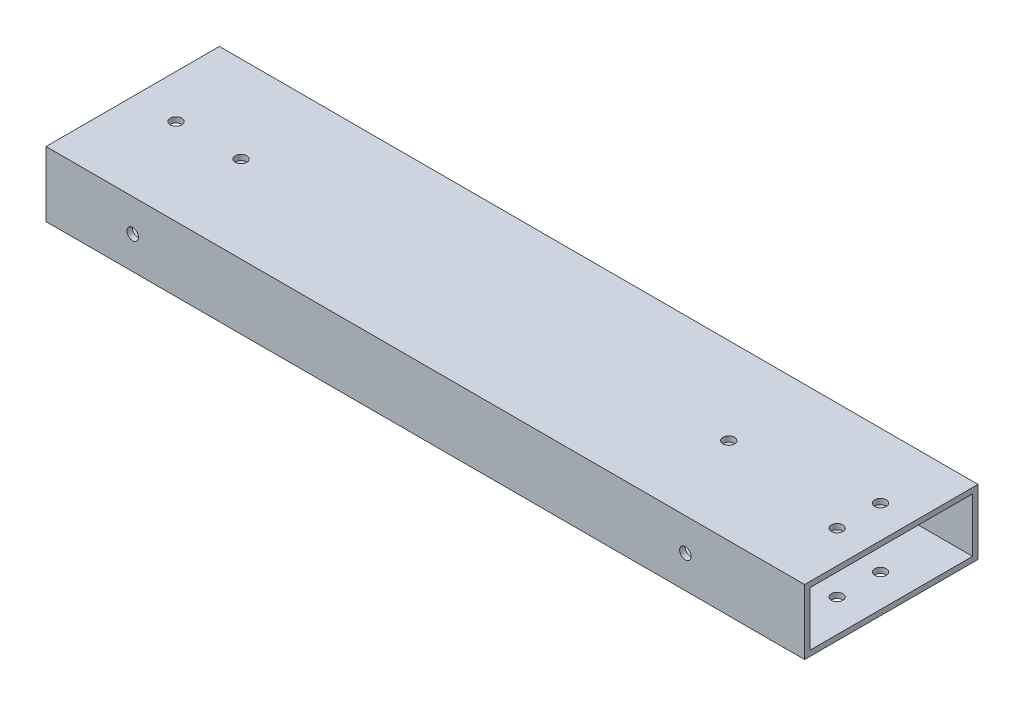
ISO-10303-21;
HEADER;
FILE_DESCRIPTION(('STEP AP214'),'2;1');
FILE_NAME('part.step','',(''),(''),'','','');
FILE_SCHEMA(('AUTOMOTIVE_DESIGN { 1 0 10303 214 1 1 1 1 }'));
ENDSEC;
DATA;
#1=APPLICATION_CONTEXT('core data for automotive mechanical design processes');
#2=APPLICATION_PROTOCOL_DEFINITION('international standard','automotive_design',2000,#1);
#3=PRODUCT_CONTEXT('',#1,'mechanical');
#4=PRODUCT('Part','Part','',(#3));
#5=PRODUCT_RELATED_PRODUCT_CATEGORY('part','',(#4));
#6=PRODUCT_DEFINITION_FORMATION('','',#4);
#7=PRODUCT_DEFINITION_CONTEXT('part definition',#1,'design');
#8=PRODUCT_DEFINITION('design','',#6,#7);
#9=PRODUCT_DEFINITION_SHAPE('','',#8);
#10=(LENGTH_UNIT() NAMED_UNIT(*) SI_UNIT(.MILLI.,.METRE.));
#11=(NAMED_UNIT(*) PLANE_ANGLE_UNIT() SI_UNIT($,.RADIAN.));
#12=(NAMED_UNIT(*) SI_UNIT($,.STERADIAN.) SOLID_ANGLE_UNIT());
#13=UNCERTAINTY_MEASURE_WITH_UNIT(LENGTH_MEASURE(1.E-05),#10,'distance_accuracy_value','');
#14=(GEOMETRIC_REPRESENTATION_CONTEXT(3) GLOBAL_UNCERTAINTY_ASSIGNED_CONTEXT((#13)) GLOBAL_UNIT_ASSIGNED_CONTEXT((#10,
#11,#12)) REPRESENTATION_CONTEXT('',''));
#15=CARTESIAN_POINT('',(0.,0.,0.));
#16=DIRECTION('',(0.,0.,1.));
#17=DIRECTION('',(1.,0.,0.));
#18=AXIS2_PLACEMENT_3D('',#15,#16,#17);
#19=CARTESIAN_POINT('',(444.5,-15.875,0.));
#20=DIRECTION('',(0.,-1.,0.));
#21=DIRECTION('',(0.,0.,-1.));
#22=AXIS2_PLACEMENT_3D('',#19,#20,#21);
#23=PLANE('',#22);
#24=CARTESIAN_POINT('',(25.4,-15.875,0.));
#25=DIRECTION('',(0.,-1.,0.));
#26=DIRECTION('',(0.,0.,-1.));
#27=AXIS2_PLACEMENT_3D('',#24,#25,#26);
#28=CIRCLE('',#27,3.37819999999999);
#29=CARTESIAN_POINT('',(25.4,-15.875,-3.37819999999999));
#30=VERTEX_POINT('',#29);
#31=EDGE_CURVE('E235',#30,#30,#28,.T.);
#32=ORIENTED_EDGE('',*,*,#31,.T.);
#33=EDGE_LOOP('',(#32));
#34=FACE_BOUND('',#33,.T.);
#35=CARTESIAN_POINT('',(63.5,-15.875,0.));
#36=DIRECTION('',(0.,-1.,0.));
#37=DIRECTION('',(0.,0.,-1.));
#38=AXIS2_PLACEMENT_3D('',#35,#36,#37);
#39=CIRCLE('',#38,3.37819999999998);
#40=CARTESIAN_POINT('',(63.5,-15.875,-3.37819999999998));
#41=VERTEX_POINT('',#40);
#42=EDGE_CURVE('E223',#41,#41,#39,.T.);
#43=ORIENTED_EDGE('',*,*,#42,.T.);
#44=EDGE_LOOP('',(#43));
#45=FACE_BOUND('',#44,.T.);
#46=CARTESIAN_POINT('',(349.25,-15.875,0.));
#47=DIRECTION('',(0.,-1.,0.));
#48=DIRECTION('',(0.,0.,-1.));
#49=AXIS2_PLACEMENT_3D('',#46,#47,#48);
#50=CIRCLE('',#49,3.3782);
#51=CARTESIAN_POINT('',(349.25,-15.875,-3.3782));
#52=VERTEX_POINT('',#51);
#53=EDGE_CURVE('E211',#52,#52,#50,.T.);
#54=ORIENTED_EDGE('',*,*,#53,.T.);
#55=EDGE_LOOP('',(#54));
#56=FACE_BOUND('',#55,.T.);
#57=CARTESIAN_POINT('',(425.45,-15.875,-12.7));
#58=DIRECTION('',(0.,-1.,0.));
#59=DIRECTION('',(0.,0.,-1.));
#60=AXIS2_PLACEMENT_3D('',#57,#58,#59);
#61=CIRCLE('',#60,3.3782);
#62=CARTESIAN_POINT('',(425.45,-15.875,-16.0782));
#63=VERTEX_POINT('',#62);
#64=EDGE_CURVE('E199',#63,#63,#61,.T.);
#65=ORIENTED_EDGE('',*,*,#64,.T.);
#66=EDGE_LOOP('',(#65));
#67=FACE_BOUND('',#66,.T.);
#68=CARTESIAN_POINT('',(425.45,-15.875,12.7));
#69=DIRECTION('',(0.,-1.,0.));
#70=DIRECTION('',(0.,0.,-1.));
#71=AXIS2_PLACEMENT_3D('',#68,#69,#70);
#72=CIRCLE('',#71,3.3782);
#73=CARTESIAN_POINT('',(425.45,-15.875,9.3218));
#74=VERTEX_POINT('',#73);
#75=EDGE_CURVE('E137',#74,#74,#72,.T.);
#76=ORIENTED_EDGE('',*,*,#75,.T.);
#77=EDGE_LOOP('',(#76));
#78=FACE_BOUND('',#77,.T.);
#79=DIRECTION('',(0.,0.,1.));
#80=VECTOR('',#79,1.);
#81=CARTESIAN_POINT('',(0.,-15.875,0.));
#82=LINE('',#81,#80);
#83=CARTESIAN_POINT('',(0.,-15.875,-47.625));
#84=VERTEX_POINT('',#83);
#85=CARTESIAN_POINT('',(0.,-15.875,47.625));
#86=VERTEX_POINT('',#85);
#87=EDGE_CURVE('E146',#84,#86,#82,.T.);
#88=ORIENTED_EDGE('',*,*,#87,.T.);
#89=DIRECTION('',(-1.,0.,0.));
#90=VECTOR('',#89,1.);
#91=CARTESIAN_POINT('',(444.5,-15.875,47.625));
#92=LINE('',#91,#90);
#93=CARTESIAN_POINT('',(444.5,-15.875,47.625));
#94=VERTEX_POINT('',#93);
#95=EDGE_CURVE('E11',#94,#86,#92,.T.);
#96=ORIENTED_EDGE('',*,*,#95,.F.);
#97=DIRECTION('',(0.,0.,1.));
#98=VECTOR('',#97,1.);
#99=CARTESIAN_POINT('',(444.5,-15.875,0.));
#100=LINE('',#99,#98);
#101=CARTESIAN_POINT('',(444.5,-15.875,-47.625));
#102=VERTEX_POINT('',#101);
#103=EDGE_CURVE('E116',#102,#94,#100,.T.);
#104=ORIENTED_EDGE('',*,*,#103,.F.);
#105=DIRECTION('',(-1.,0.,0.));
#106=VECTOR('',#105,1.);
#107=CARTESIAN_POINT('',(444.5,-15.875,-47.625));
#108=LINE('',#107,#106);
#109=EDGE_CURVE('E55',#102,#84,#108,.T.);
#110=ORIENTED_EDGE('',*,*,#109,.T.);
#111=EDGE_LOOP('',(#88,#96,#104,#110));
#112=FACE_BOUND('',#111,.T.);
#113=ADVANCED_FACE('F36',(#34,#45,#56,#67,#78,#112),#23,.F.);
#114=CARTESIAN_POINT('',(444.5,0.,47.625));
#115=DIRECTION('',(0.,0.,1.));
#116=DIRECTION('',(1.,0.,0.));
#117=AXIS2_PLACEMENT_3D('',#114,#115,#116);
#118=PLANE('',#117);
#119=CARTESIAN_POINT('',(50.8,0.,47.625));
#120=DIRECTION('',(0.,0.,1.));
#121=DIRECTION('',(1.,0.,0.));
#122=AXIS2_PLACEMENT_3D('',#119,#120,#121);
#123=CIRCLE('',#122,3.37819999999999);
#124=CARTESIAN_POINT('',(54.1782,0.,47.625));
#125=VERTEX_POINT('',#124);
#126=EDGE_CURVE('E259',#125,#125,#123,.T.);
#127=ORIENTED_EDGE('',*,*,#126,.T.);
#128=EDGE_LOOP('',(#127));
#129=FACE_BOUND('',#128,.T.);
#130=CARTESIAN_POINT('',(374.65,0.,47.625));
#131=DIRECTION('',(0.,0.,1.));
#132=DIRECTION('',(1.,0.,0.));
#133=AXIS2_PLACEMENT_3D('',#130,#131,#132);
#134=CIRCLE('',#133,3.3782);
#135=CARTESIAN_POINT('',(378.0282,0.,47.625));
#136=VERTEX_POINT('',#135);
#137=EDGE_CURVE('E247',#136,#136,#134,.T.);
#138=ORIENTED_EDGE('',*,*,#137,.T.);
#139=EDGE_LOOP('',(#138));
#140=FACE_BOUND('',#139,.T.);
#141=DIRECTION('',(0.,1.,0.));
#142=VECTOR('',#141,1.);
#143=CARTESIAN_POINT('',(0.,0.,47.625));
#144=LINE('',#143,#142);
#145=CARTESIAN_POINT('',(0.,15.875,47.625));
#146=VERTEX_POINT('',#145);
#147=EDGE_CURVE('E122',#86,#146,#144,.T.);
#148=ORIENTED_EDGE('',*,*,#147,.T.);
#149=DIRECTION('',(-1.,0.,0.));
#150=VECTOR('',#149,1.);
#151=CARTESIAN_POINT('',(444.5,15.875,47.625));
#152=LINE('',#151,#150);
#153=CARTESIAN_POINT('',(444.5,15.875,47.625));
#154=VERTEX_POINT('',#153);
#155=EDGE_CURVE('E46',#154,#146,#152,.T.);
#156=ORIENTED_EDGE('',*,*,#155,.F.);
#157=DIRECTION('',(0.,1.,0.));
#158=VECTOR('',#157,1.);
#159=CARTESIAN_POINT('',(444.5,0.,47.625));
#160=LINE('',#159,#158);
#161=EDGE_CURVE('E110',#94,#154,#160,.T.);
#162=ORIENTED_EDGE('',*,*,#161,.F.);
#163=ORIENTED_EDGE('',*,*,#95,.T.);
#164=EDGE_LOOP('',(#148,#156,#162,#163));
#165=FACE_BOUND('',#164,.T.);
#166=ADVANCED_FACE('F121',(#129,#140,#165),#118,.F.);
#167=CARTESIAN_POINT('',(444.5,15.875,0.));
#168=DIRECTION('',(0.,-1.,0.));
#169=DIRECTION('',(0.,0.,-1.));
#170=AXIS2_PLACEMENT_3D('',#167,#168,#169);
#171=PLANE('',#170);
#172=CARTESIAN_POINT('',(25.4,15.875,0.));
#173=DIRECTION('',(0.,-1.,0.));
#174=DIRECTION('',(0.,0.,-1.));
#175=AXIS2_PLACEMENT_3D('',#172,#173,#174);
#176=CIRCLE('',#175,3.37819999999999);
#177=CARTESIAN_POINT('',(25.4,15.875,-3.37819999999999));
#178=VERTEX_POINT('',#177);
#179=EDGE_CURVE('E238',#178,#178,#176,.T.);
#180=ORIENTED_EDGE('',*,*,#179,.F.);
#181=EDGE_LOOP('',(#180));
#182=FACE_BOUND('',#181,.T.);
#183=CARTESIAN_POINT('',(63.5,15.875,0.));
#184=DIRECTION('',(0.,-1.,0.));
#185=DIRECTION('',(0.,0.,-1.));
#186=AXIS2_PLACEMENT_3D('',#183,#184,#185);
#187=CIRCLE('',#186,3.37819999999998);
#188=CARTESIAN_POINT('',(63.5,15.875,-3.37819999999998));
#189=VERTEX_POINT('',#188);
#190=EDGE_CURVE('E226',#189,#189,#187,.T.);
#191=ORIENTED_EDGE('',*,*,#190,.F.);
#192=EDGE_LOOP('',(#191));
#193=FACE_BOUND('',#192,.T.);
#194=CARTESIAN_POINT('',(349.25,15.875,0.));
#195=DIRECTION('',(0.,-1.,0.));
#196=DIRECTION('',(0.,0.,-1.));
#197=AXIS2_PLACEMENT_3D('',#194,#195,#196);
#198=CIRCLE('',#197,3.3782);
#199=CARTESIAN_POINT('',(349.25,15.875,-3.3782));
#200=VERTEX_POINT('',#199);
#201=EDGE_CURVE('E214',#200,#200,#198,.T.);
#202=ORIENTED_EDGE('',*,*,#201,.F.);
#203=EDGE_LOOP('',(#202));
#204=FACE_BOUND('',#203,.T.);
#205=CARTESIAN_POINT('',(425.45,15.875,-12.7));
#206=DIRECTION('',(0.,-1.,0.));
#207=DIRECTION('',(0.,0.,-1.));
#208=AXIS2_PLACEMENT_3D('',#205,#206,#207);
#209=CIRCLE('',#208,3.3782);
#210=CARTESIAN_POINT('',(425.45,15.875,-16.0782));
#211=VERTEX_POINT('',#210);
#212=EDGE_CURVE('E202',#211,#211,#209,.T.);
#213=ORIENTED_EDGE('',*,*,#212,.F.);
#214=EDGE_LOOP('',(#213));
#215=FACE_BOUND('',#214,.T.);
#216=CARTESIAN_POINT('',(425.45,15.875,12.7));
#217=DIRECTION('',(0.,-1.,0.));
#218=DIRECTION('',(0.,0.,-1.));
#219=AXIS2_PLACEMENT_3D('',#216,#217,#218);
#220=CIRCLE('',#219,3.3782);
#221=CARTESIAN_POINT('',(425.45,15.875,9.3218));
#222=VERTEX_POINT('',#221);
#223=EDGE_CURVE('E190',#222,#222,#220,.T.);
#224=ORIENTED_EDGE('',*,*,#223,.F.);
#225=EDGE_LOOP('',(#224));
#226=FACE_BOUND('',#225,.T.);
#227=DIRECTION('',(0.,0.,1.));
#228=VECTOR('',#227,1.);
#229=CARTESIAN_POINT('',(0.,15.875,0.));
#230=LINE('',#229,#228);
#231=CARTESIAN_POINT('',(0.,15.875,-47.625));
#232=VERTEX_POINT('',#231);
#233=EDGE_CURVE('E149',#232,#146,#230,.T.);
#234=ORIENTED_EDGE('',*,*,#233,.F.);
#235=DIRECTION('',(-1.,0.,0.));
#236=VECTOR('',#235,1.);
#237=CARTESIAN_POINT('',(444.5,15.875,-47.625));
#238=LINE('',#237,#236);
#239=CARTESIAN_POINT('',(444.5,15.875,-47.625));
#240=VERTEX_POINT('',#239);
#241=EDGE_CURVE('E81',#240,#232,#238,.T.);
#242=ORIENTED_EDGE('',*,*,#241,.F.);
#243=DIRECTION('',(0.,0.,1.));
#244=VECTOR('',#243,1.);
#245=CARTESIAN_POINT('',(444.5,15.875,0.));
#246=LINE('',#245,#244);
#247=EDGE_CURVE('E115',#240,#154,#246,.T.);
#248=ORIENTED_EDGE('',*,*,#247,.T.);
#249=ORIENTED_EDGE('',*,*,#155,.T.);
#250=EDGE_LOOP('',(#234,#242,#248,#249));
#251=FACE_BOUND('',#250,.T.);
#252=ADVANCED_FACE('F126',(#182,#193,#204,#215,#226,#251),#171,.T.);
#253=CARTESIAN_POINT('',(444.5,-19.05,0.));
#254=DIRECTION('',(0.,1.,0.));
#255=DIRECTION('',(0.,0.,1.));
#256=AXIS2_PLACEMENT_3D('',#253,#254,#255);
#257=PLANE('',#256);
#258=CARTESIAN_POINT('',(25.4,-19.05,0.));
#259=DIRECTION('',(0.,1.,0.));
#260=DIRECTION('',(0.,0.,1.));
#261=AXIS2_PLACEMENT_3D('',#258,#259,#260);
#262=CIRCLE('',#261,3.37819999999999);
#263=CARTESIAN_POINT('',(25.4,-19.05,3.37819999999999));
#264=VERTEX_POINT('',#263);
#265=EDGE_CURVE('E241',#264,#264,#262,.T.);
#266=ORIENTED_EDGE('',*,*,#265,.T.);
#267=EDGE_LOOP('',(#266));
#268=FACE_BOUND('',#267,.T.);
#269=CARTESIAN_POINT('',(63.5,-19.05,0.));
#270=DIRECTION('',(0.,1.,0.));
#271=DIRECTION('',(0.,0.,1.));
#272=AXIS2_PLACEMENT_3D('',#269,#270,#271);
#273=CIRCLE('',#272,3.37819999999998);
#274=CARTESIAN_POINT('',(63.5,-19.05,3.37819999999998));
#275=VERTEX_POINT('',#274);
#276=EDGE_CURVE('E229',#275,#275,#273,.T.);
#277=ORIENTED_EDGE('',*,*,#276,.T.);
#278=EDGE_LOOP('',(#277));
#279=FACE_BOUND('',#278,.T.);
#280=CARTESIAN_POINT('',(349.25,-19.05,0.));
#281=DIRECTION('',(0.,1.,0.));
#282=DIRECTION('',(0.,0.,1.));
#283=AXIS2_PLACEMENT_3D('',#280,#281,#282);
#284=CIRCLE('',#283,3.3782);
#285=CARTESIAN_POINT('',(349.25,-19.05,3.3782));
#286=VERTEX_POINT('',#285);
#287=EDGE_CURVE('E217',#286,#286,#284,.T.);
#288=ORIENTED_EDGE('',*,*,#287,.T.);
#289=EDGE_LOOP('',(#288));
#290=FACE_BOUND('',#289,.T.);
#291=CARTESIAN_POINT('',(425.45,-19.05,-12.7));
#292=DIRECTION('',(0.,1.,0.));
#293=DIRECTION('',(0.,0.,1.));
#294=AXIS2_PLACEMENT_3D('',#291,#292,#293);
#295=CIRCLE('',#294,3.3782);
#296=CARTESIAN_POINT('',(425.45,-19.05,-9.3218));
#297=VERTEX_POINT('',#296);
#298=EDGE_CURVE('E205',#297,#297,#295,.T.);
#299=ORIENTED_EDGE('',*,*,#298,.T.);
#300=EDGE_LOOP('',(#299));
#301=FACE_BOUND('',#300,.T.);
#302=CARTESIAN_POINT('',(425.45,-19.05,12.7));
#303=DIRECTION('',(0.,1.,0.));
#304=DIRECTION('',(0.,0.,1.));
#305=AXIS2_PLACEMENT_3D('',#302,#303,#304);
#306=CIRCLE('',#305,3.3782);
#307=CARTESIAN_POINT('',(425.45,-19.05,16.0782));
#308=VERTEX_POINT('',#307);
#309=EDGE_CURVE('E193',#308,#308,#306,.T.);
#310=ORIENTED_EDGE('',*,*,#309,.T.);
#311=EDGE_LOOP('',(#310));
#312=FACE_BOUND('',#311,.T.);
#313=DIRECTION('',(0.,0.,-1.));
#314=VECTOR('',#313,1.);
#315=CARTESIAN_POINT('',(0.,-19.05,0.));
#316=LINE('',#315,#314);
#317=CARTESIAN_POINT('',(0.,-19.05,50.8));
#318=VERTEX_POINT('',#317);
#319=CARTESIAN_POINT('',(0.,-19.05,-50.8));
#320=VERTEX_POINT('',#319);
#321=EDGE_CURVE('E133',#318,#320,#316,.T.);
#322=ORIENTED_EDGE('',*,*,#321,.T.);
#323=DIRECTION('',(-1.,0.,0.));
#324=VECTOR('',#323,1.);
#325=CARTESIAN_POINT('',(444.5,-19.05,-50.8));
#326=LINE('',#325,#324);
#327=CARTESIAN_POINT('',(444.5,-19.05,-50.8));
#328=VERTEX_POINT('',#327);
#329=EDGE_CURVE('E156',#328,#320,#326,.T.);
#330=ORIENTED_EDGE('',*,*,#329,.F.);
#331=DIRECTION('',(0.,0.,-1.));
#332=VECTOR('',#331,1.);
#333=CARTESIAN_POINT('',(444.5,-19.05,0.));
#334=LINE('',#333,#332);
#335=CARTESIAN_POINT('',(444.5,-19.05,50.8));
#336=VERTEX_POINT('',#335);
#337=EDGE_CURVE('E154',#336,#328,#334,.T.);
#338=ORIENTED_EDGE('',*,*,#337,.F.);
#339=DIRECTION('',(-1.,0.,0.));
#340=VECTOR('',#339,1.);
#341=CARTESIAN_POINT('',(444.5,-19.05,50.8));
#342=LINE('',#341,#340);
#343=EDGE_CURVE('E129',#336,#318,#342,.T.);
#344=ORIENTED_EDGE('',*,*,#343,.T.);
#345=EDGE_LOOP('',(#322,#330,#338,#344));
#346=FACE_BOUND('',#345,.T.);
#347=ADVANCED_FACE('F38',(#268,#279,#290,#301,#312,#346),#257,.F.);
#348=CARTESIAN_POINT('',(444.5,0.,-50.8));
#349=DIRECTION('',(0.,0.,1.));
#350=DIRECTION('',(1.,0.,0.));
#351=AXIS2_PLACEMENT_3D('',#348,#349,#350);
#352=PLANE('',#351);
#353=CARTESIAN_POINT('',(50.8,0.,-50.8));
#354=DIRECTION('',(0.,0.,-1.));
#355=DIRECTION('',(-1.,0.,0.));
#356=AXIS2_PLACEMENT_3D('',#353,#354,#355);
#357=CIRCLE('',#356,3.3782);
#358=CARTESIAN_POINT('',(47.4218,0.,-50.8));
#359=VERTEX_POINT('',#358);
#360=EDGE_CURVE('E265',#359,#359,#357,.T.);
#361=ORIENTED_EDGE('',*,*,#360,.F.);
#362=EDGE_LOOP('',(#361));
#363=FACE_BOUND('',#362,.T.);
#364=CARTESIAN_POINT('',(374.65,0.,-50.8));
#365=DIRECTION('',(0.,0.,-1.));
#366=DIRECTION('',(-1.,0.,0.));
#367=AXIS2_PLACEMENT_3D('',#364,#365,#366);
#368=CIRCLE('',#367,3.3782);
#369=CARTESIAN_POINT('',(371.2718,0.,-50.8));
#370=VERTEX_POINT('',#369);
#371=EDGE_CURVE('E256',#370,#370,#368,.T.);
#372=ORIENTED_EDGE('',*,*,#371,.F.);
#373=EDGE_LOOP('',(#372));
#374=FACE_BOUND('',#373,.T.);
#375=DIRECTION('',(0.,1.,0.));
#376=VECTOR('',#375,1.);
#377=CARTESIAN_POINT('',(0.,0.,-50.8));
#378=LINE('',#377,#376);
#379=CARTESIAN_POINT('',(0.,19.05,-50.8));
#380=VERTEX_POINT('',#379);
#381=EDGE_CURVE('E136',#320,#380,#378,.T.);
#382=ORIENTED_EDGE('',*,*,#381,.T.);
#383=DIRECTION('',(-1.,0.,0.));
#384=VECTOR('',#383,1.);
#385=CARTESIAN_POINT('',(444.5,19.05,-50.8));
#386=LINE('',#385,#384);
#387=CARTESIAN_POINT('',(444.5,19.05,-50.8));
#388=VERTEX_POINT('',#387);
#389=EDGE_CURVE('E161',#388,#380,#386,.T.);
#390=ORIENTED_EDGE('',*,*,#389,.F.);
#391=DIRECTION('',(0.,1.,0.));
#392=VECTOR('',#391,1.);
#393=CARTESIAN_POINT('',(444.5,0.,-50.8));
#394=LINE('',#393,#392);
#395=EDGE_CURVE('E94',#328,#388,#394,.T.);
#396=ORIENTED_EDGE('',*,*,#395,.F.);
#397=ORIENTED_EDGE('',*,*,#329,.T.);
#398=EDGE_LOOP('',(#382,#390,#396,#397));
#399=FACE_BOUND('',#398,.T.);
#400=ADVANCED_FACE('F163',(#363,#374,#399),#352,.F.);
#401=CARTESIAN_POINT('',(444.5,19.05,0.));
#402=DIRECTION('',(0.,1.,0.));
#403=DIRECTION('',(0.,0.,1.));
#404=AXIS2_PLACEMENT_3D('',#401,#402,#403);
#405=PLANE('',#404);
#406=CARTESIAN_POINT('',(25.4,19.05,0.));
#407=DIRECTION('',(0.,1.,0.));
#408=DIRECTION('',(0.,0.,1.));
#409=AXIS2_PLACEMENT_3D('',#406,#407,#408);
#410=CIRCLE('',#409,3.37819999999999);
#411=CARTESIAN_POINT('',(25.4,19.05,3.37819999999999));
#412=VERTEX_POINT('',#411);
#413=EDGE_CURVE('E244',#412,#412,#410,.T.);
#414=ORIENTED_EDGE('',*,*,#413,.F.);
#415=EDGE_LOOP('',(#414));
#416=FACE_BOUND('',#415,.T.);
#417=CARTESIAN_POINT('',(63.5,19.05,0.));
#418=DIRECTION('',(0.,1.,0.));
#419=DIRECTION('',(0.,0.,1.));
#420=AXIS2_PLACEMENT_3D('',#417,#418,#419);
#421=CIRCLE('',#420,3.37819999999998);
#422=CARTESIAN_POINT('',(63.5,19.05,3.37819999999998));
#423=VERTEX_POINT('',#422);
#424=EDGE_CURVE('E232',#423,#423,#421,.T.);
#425=ORIENTED_EDGE('',*,*,#424,.F.);
#426=EDGE_LOOP('',(#425));
#427=FACE_BOUND('',#426,.T.);
#428=CARTESIAN_POINT('',(349.25,19.05,0.));
#429=DIRECTION('',(0.,1.,0.));
#430=DIRECTION('',(0.,0.,1.));
#431=AXIS2_PLACEMENT_3D('',#428,#429,#430);
#432=CIRCLE('',#431,3.3782);
#433=CARTESIAN_POINT('',(349.25,19.05,3.3782));
#434=VERTEX_POINT('',#433);
#435=EDGE_CURVE('E220',#434,#434,#432,.T.);
#436=ORIENTED_EDGE('',*,*,#435,.F.);
#437=EDGE_LOOP('',(#436));
#438=FACE_BOUND('',#437,.T.);
#439=CARTESIAN_POINT('',(425.45,19.05,-12.7));
#440=DIRECTION('',(0.,1.,0.));
#441=DIRECTION('',(0.,0.,1.));
#442=AXIS2_PLACEMENT_3D('',#439,#440,#441);
#443=CIRCLE('',#442,3.3782);
#444=CARTESIAN_POINT('',(425.45,19.05,-9.3218));
#445=VERTEX_POINT('',#444);
#446=EDGE_CURVE('E208',#445,#445,#443,.T.);
#447=ORIENTED_EDGE('',*,*,#446,.F.);
#448=EDGE_LOOP('',(#447));
#449=FACE_BOUND('',#448,.T.);
#450=CARTESIAN_POINT('',(425.45,19.05,12.7));
#451=DIRECTION('',(0.,1.,0.));
#452=DIRECTION('',(0.,0.,1.));
#453=AXIS2_PLACEMENT_3D('',#450,#451,#452);
#454=CIRCLE('',#453,3.3782);
#455=CARTESIAN_POINT('',(425.45,19.05,16.0782));
#456=VERTEX_POINT('',#455);
#457=EDGE_CURVE('E196',#456,#456,#454,.T.);
#458=ORIENTED_EDGE('',*,*,#457,.F.);
#459=EDGE_LOOP('',(#458));
#460=FACE_BOUND('',#459,.T.);
#461=DIRECTION('',(0.,0.,-1.));
#462=VECTOR('',#461,1.);
#463=CARTESIAN_POINT('',(0.,19.05,0.));
#464=LINE('',#463,#462);
#465=CARTESIAN_POINT('',(0.,19.05,50.8));
#466=VERTEX_POINT('',#465);
#467=EDGE_CURVE('E140',#466,#380,#464,.T.);
#468=ORIENTED_EDGE('',*,*,#467,.F.);
#469=DIRECTION('',(-1.,0.,0.));
#470=VECTOR('',#469,1.);
#471=CARTESIAN_POINT('',(444.5,19.05,50.8));
#472=LINE('',#471,#470);
#473=CARTESIAN_POINT('',(444.5,19.05,50.8));
#474=VERTEX_POINT('',#473);
#475=EDGE_CURVE('E159',#474,#466,#472,.T.);
#476=ORIENTED_EDGE('',*,*,#475,.F.);
#477=DIRECTION('',(0.,0.,-1.));
#478=VECTOR('',#477,1.);
#479=CARTESIAN_POINT('',(444.5,19.05,0.));
#480=LINE('',#479,#478);
#481=EDGE_CURVE('E181',#474,#388,#480,.T.);
#482=ORIENTED_EDGE('',*,*,#481,.T.);
#483=ORIENTED_EDGE('',*,*,#389,.T.);
#484=EDGE_LOOP('',(#468,#476,#482,#483));
#485=FACE_BOUND('',#484,.T.);
#486=ADVANCED_FACE('F180',(#416,#427,#438,#449,#460,#485),#405,.T.);
#487=CARTESIAN_POINT('',(444.5,0.,50.8));
#488=DIRECTION('',(0.,0.,1.));
#489=DIRECTION('',(1.,0.,0.));
#490=AXIS2_PLACEMENT_3D('',#487,#488,#489);
#491=PLANE('',#490);
#492=CARTESIAN_POINT('',(50.8,0.,50.8));
#493=DIRECTION('',(0.,0.,-1.));
#494=DIRECTION('',(-1.,0.,0.));
#495=AXIS2_PLACEMENT_3D('',#492,#493,#494);
#496=CIRCLE('',#495,3.37819999999998);
#497=CARTESIAN_POINT('',(47.4218,0.,50.8));
#498=VERTEX_POINT('',#497);
#499=EDGE_CURVE('E262',#498,#498,#496,.T.);
#500=ORIENTED_EDGE('',*,*,#499,.T.);
#501=EDGE_LOOP('',(#500));
#502=FACE_BOUND('',#501,.T.);
#503=CARTESIAN_POINT('',(374.65,0.,50.8));
#504=DIRECTION('',(0.,0.,-1.));
#505=DIRECTION('',(-1.,0.,0.));
#506=AXIS2_PLACEMENT_3D('',#503,#504,#505);
#507=CIRCLE('',#506,3.3782);
#508=CARTESIAN_POINT('',(371.2718,0.,50.8));
#509=VERTEX_POINT('',#508);
#510=EDGE_CURVE('E253',#509,#509,#507,.T.);
#511=ORIENTED_EDGE('',*,*,#510,.T.);
#512=EDGE_LOOP('',(#511));
#513=FACE_BOUND('',#512,.T.);
#514=DIRECTION('',(0.,1.,0.));
#515=VECTOR('',#514,1.);
#516=CARTESIAN_POINT('',(0.,0.,50.8));
#517=LINE('',#516,#515);
#518=EDGE_CURVE('E143',#318,#466,#517,.T.);
#519=ORIENTED_EDGE('',*,*,#518,.F.);
#520=ORIENTED_EDGE('',*,*,#343,.F.);
#521=DIRECTION('',(0.,1.,0.));
#522=VECTOR('',#521,1.);
#523=CARTESIAN_POINT('',(444.5,0.,50.8));
#524=LINE('',#523,#522);
#525=EDGE_CURVE('E176',#336,#474,#524,.T.);
#526=ORIENTED_EDGE('',*,*,#525,.T.);
#527=ORIENTED_EDGE('',*,*,#475,.T.);
#528=EDGE_LOOP('',(#519,#520,#526,#527));
#529=FACE_BOUND('',#528,.T.);
#530=ADVANCED_FACE('F172',(#502,#513,#529),#491,.T.);
#531=CARTESIAN_POINT('',(444.5,0.,-47.625));
#532=DIRECTION('',(0.,0.,1.));
#533=DIRECTION('',(1.,0.,0.));
#534=AXIS2_PLACEMENT_3D('',#531,#532,#533);
#535=PLANE('',#534);
#536=CARTESIAN_POINT('',(50.8,0.,-47.625));
#537=DIRECTION('',(0.,0.,1.));
#538=DIRECTION('',(1.,0.,0.));
#539=AXIS2_PLACEMENT_3D('',#536,#537,#538);
#540=CIRCLE('',#539,3.37819999999999);
#541=CARTESIAN_POINT('',(54.1782,0.,-47.625));
#542=VERTEX_POINT('',#541);
#543=EDGE_CURVE('E40',#542,#542,#540,.T.);
#544=ORIENTED_EDGE('',*,*,#543,.F.);
#545=EDGE_LOOP('',(#544));
#546=FACE_BOUND('',#545,.T.);
#547=CARTESIAN_POINT('',(374.65,0.,-47.625));
#548=DIRECTION('',(0.,0.,1.));
#549=DIRECTION('',(1.,0.,0.));
#550=AXIS2_PLACEMENT_3D('',#547,#548,#549);
#551=CIRCLE('',#550,3.3782);
#552=CARTESIAN_POINT('',(378.0282,0.,-47.625));
#553=VERTEX_POINT('',#552);
#554=EDGE_CURVE('E250',#553,#553,#551,.T.);
#555=ORIENTED_EDGE('',*,*,#554,.F.);
#556=EDGE_LOOP('',(#555));
#557=FACE_BOUND('',#556,.T.);
#558=DIRECTION('',(0.,1.,0.));
#559=VECTOR('',#558,1.);
#560=CARTESIAN_POINT('',(0.,0.,-47.625));
#561=LINE('',#560,#559);
#562=EDGE_CURVE('E151',#84,#232,#561,.T.);
#563=ORIENTED_EDGE('',*,*,#562,.F.);
#564=ORIENTED_EDGE('',*,*,#109,.F.);
#565=DIRECTION('',(0.,1.,0.));
#566=VECTOR('',#565,1.);
#567=CARTESIAN_POINT('',(444.5,0.,-47.625));
#568=LINE('',#567,#566);
#569=EDGE_CURVE('E127',#102,#240,#568,.T.);
#570=ORIENTED_EDGE('',*,*,#569,.T.);
#571=ORIENTED_EDGE('',*,*,#241,.T.);
#572=EDGE_LOOP('',(#563,#564,#570,#571));
#573=FACE_BOUND('',#572,.T.);
#574=ADVANCED_FACE('F303',(#546,#557,#573),#535,.T.);
#575=CARTESIAN_POINT('',(444.5,0.,0.));
#576=DIRECTION('',(1.,0.,0.));
#577=DIRECTION('',(0.,0.,-1.));
#578=AXIS2_PLACEMENT_3D('',#575,#576,#577);
#579=PLANE('',#578);
#580=ORIENTED_EDGE('',*,*,#337,.T.);
#581=ORIENTED_EDGE('',*,*,#395,.T.);
#582=ORIENTED_EDGE('',*,*,#481,.F.);
#583=ORIENTED_EDGE('',*,*,#525,.F.);
#584=EDGE_LOOP('',(#580,#581,#582,#583));
#585=FACE_BOUND('',#584,.T.);
#586=ORIENTED_EDGE('',*,*,#103,.T.);
#587=ORIENTED_EDGE('',*,*,#161,.T.);
#588=ORIENTED_EDGE('',*,*,#247,.F.);
#589=ORIENTED_EDGE('',*,*,#569,.F.);
#590=EDGE_LOOP('',(#586,#587,#588,#589));
#591=FACE_BOUND('',#590,.T.);
#592=ADVANCED_FACE('F112',(#585,#591),#579,.T.);
#593=CARTESIAN_POINT('',(0.,0.,0.));
#594=DIRECTION('',(1.,0.,0.));
#595=DIRECTION('',(0.,0.,-1.));
#596=AXIS2_PLACEMENT_3D('',#593,#594,#595);
#597=PLANE('',#596);
#598=ORIENTED_EDGE('',*,*,#321,.F.);
#599=ORIENTED_EDGE('',*,*,#518,.T.);
#600=ORIENTED_EDGE('',*,*,#467,.T.);
#601=ORIENTED_EDGE('',*,*,#381,.F.);
#602=EDGE_LOOP('',(#598,#599,#600,#601));
#603=FACE_BOUND('',#602,.T.);
#604=ORIENTED_EDGE('',*,*,#87,.F.);
#605=ORIENTED_EDGE('',*,*,#562,.T.);
#606=ORIENTED_EDGE('',*,*,#233,.T.);
#607=ORIENTED_EDGE('',*,*,#147,.F.);
#608=EDGE_LOOP('',(#604,#605,#606,#607));
#609=FACE_BOUND('',#608,.T.);
#610=ADVANCED_FACE('F169',(#603,#609),#597,.F.);
#611=CARTESIAN_POINT('',(425.45,19.05,12.7));
#612=DIRECTION('',(0.,1.,0.));
#613=DIRECTION('',(0.,0.,1.));
#614=AXIS2_PLACEMENT_3D('',#611,#612,#613);
#615=CYLINDRICAL_SURFACE('',#614,3.3782);
#616=ORIENTED_EDGE('',*,*,#223,.T.);
#617=EDGE_LOOP('',(#616));
#618=FACE_BOUND('',#617,.T.);
#619=ORIENTED_EDGE('',*,*,#457,.T.);
#620=EDGE_LOOP('',(#619));
#621=FACE_BOUND('',#620,.T.);
#622=ADVANCED_FACE('F319',(#618,#621),#615,.F.);
#623=ORIENTED_EDGE('',*,*,#309,.F.);
#624=EDGE_LOOP('',(#623));
#625=FACE_BOUND('',#624,.T.);
#626=ORIENTED_EDGE('',*,*,#75,.F.);
#627=EDGE_LOOP('',(#626));
#628=FACE_BOUND('',#627,.T.);
#629=ADVANCED_FACE('F321',(#625,#628),#615,.F.);
#630=CARTESIAN_POINT('',(425.45,19.05,-12.7));
#631=DIRECTION('',(0.,1.,0.));
#632=DIRECTION('',(0.,0.,1.));
#633=AXIS2_PLACEMENT_3D('',#630,#631,#632);
#634=CYLINDRICAL_SURFACE('',#633,3.3782);
#635=ORIENTED_EDGE('',*,*,#212,.T.);
#636=EDGE_LOOP('',(#635));
#637=FACE_BOUND('',#636,.T.);
#638=ORIENTED_EDGE('',*,*,#446,.T.);
#639=EDGE_LOOP('',(#638));
#640=FACE_BOUND('',#639,.T.);
#641=ADVANCED_FACE('F328',(#637,#640),#634,.F.);
#642=ORIENTED_EDGE('',*,*,#298,.F.);
#643=EDGE_LOOP('',(#642));
#644=FACE_BOUND('',#643,.T.);
#645=ORIENTED_EDGE('',*,*,#64,.F.);
#646=EDGE_LOOP('',(#645));
#647=FACE_BOUND('',#646,.T.);
#648=ADVANCED_FACE('F356',(#644,#647),#634,.F.);
#649=CARTESIAN_POINT('',(349.25,19.05,0.));
#650=DIRECTION('',(0.,1.,0.));
#651=DIRECTION('',(0.,0.,1.));
#652=AXIS2_PLACEMENT_3D('',#649,#650,#651);
#653=CYLINDRICAL_SURFACE('',#652,3.3782);
#654=ORIENTED_EDGE('',*,*,#201,.T.);
#655=EDGE_LOOP('',(#654));
#656=FACE_BOUND('',#655,.T.);
#657=ORIENTED_EDGE('',*,*,#435,.T.);
#658=EDGE_LOOP('',(#657));
#659=FACE_BOUND('',#658,.T.);
#660=ADVANCED_FACE('F360',(#656,#659),#653,.F.);
#661=ORIENTED_EDGE('',*,*,#287,.F.);
#662=EDGE_LOOP('',(#661));
#663=FACE_BOUND('',#662,.T.);
#664=ORIENTED_EDGE('',*,*,#53,.F.);
#665=EDGE_LOOP('',(#664));
#666=FACE_BOUND('',#665,.T.);
#667=ADVANCED_FACE('F365',(#663,#666),#653,.F.);
#668=CARTESIAN_POINT('',(63.5,19.05,0.));
#669=DIRECTION('',(0.,1.,0.));
#670=DIRECTION('',(0.,0.,1.));
#671=AXIS2_PLACEMENT_3D('',#668,#669,#670);
#672=CYLINDRICAL_SURFACE('',#671,3.37819999999998);
#673=ORIENTED_EDGE('',*,*,#190,.T.);
#674=EDGE_LOOP('',(#673));
#675=FACE_BOUND('',#674,.T.);
#676=ORIENTED_EDGE('',*,*,#424,.T.);
#677=EDGE_LOOP('',(#676));
#678=FACE_BOUND('',#677,.T.);
#679=ADVANCED_FACE('F380',(#675,#678),#672,.F.);
#680=ORIENTED_EDGE('',*,*,#276,.F.);
#681=EDGE_LOOP('',(#680));
#682=FACE_BOUND('',#681,.T.);
#683=ORIENTED_EDGE('',*,*,#42,.F.);
#684=EDGE_LOOP('',(#683));
#685=FACE_BOUND('',#684,.T.);
#686=ADVANCED_FACE('F385',(#682,#685),#672,.F.);
#687=CARTESIAN_POINT('',(25.4,19.05,0.));
#688=DIRECTION('',(0.,1.,0.));
#689=DIRECTION('',(0.,0.,1.));
#690=AXIS2_PLACEMENT_3D('',#687,#688,#689);
#691=CYLINDRICAL_SURFACE('',#690,3.37819999999999);
#692=ORIENTED_EDGE('',*,*,#179,.T.);
#693=EDGE_LOOP('',(#692));
#694=FACE_BOUND('',#693,.T.);
#695=ORIENTED_EDGE('',*,*,#413,.T.);
#696=EDGE_LOOP('',(#695));
#697=FACE_BOUND('',#696,.T.);
#698=ADVANCED_FACE('F286',(#694,#697),#691,.F.);
#699=ORIENTED_EDGE('',*,*,#265,.F.);
#700=EDGE_LOOP('',(#699));
#701=FACE_BOUND('',#700,.T.);
#702=ORIENTED_EDGE('',*,*,#31,.F.);
#703=EDGE_LOOP('',(#702));
#704=FACE_BOUND('',#703,.T.);
#705=ADVANCED_FACE('F278',(#701,#704),#691,.F.);
#706=CARTESIAN_POINT('',(374.65,0.,-50.8));
#707=DIRECTION('',(0.,0.,-1.));
#708=DIRECTION('',(-1.,0.,0.));
#709=AXIS2_PLACEMENT_3D('',#706,#707,#708);
#710=CYLINDRICAL_SURFACE('',#709,3.3782);
#711=ORIENTED_EDGE('',*,*,#554,.T.);
#712=EDGE_LOOP('',(#711));
#713=FACE_BOUND('',#712,.T.);
#714=ORIENTED_EDGE('',*,*,#371,.T.);
#715=EDGE_LOOP('',(#714));
#716=FACE_BOUND('',#715,.T.);
#717=ADVANCED_FACE('F275',(#713,#716),#710,.F.);
#718=ORIENTED_EDGE('',*,*,#510,.F.);
#719=EDGE_LOOP('',(#718));
#720=FACE_BOUND('',#719,.T.);
#721=ORIENTED_EDGE('',*,*,#137,.F.);
#722=EDGE_LOOP('',(#721));
#723=FACE_BOUND('',#722,.T.);
#724=ADVANCED_FACE('F277',(#720,#723),#710,.F.);
#725=CARTESIAN_POINT('',(50.8,0.,-50.8));
#726=DIRECTION('',(0.,0.,-1.));
#727=DIRECTION('',(-1.,0.,0.));
#728=AXIS2_PLACEMENT_3D('',#725,#726,#727);
#729=CYLINDRICAL_SURFACE('',#728,3.37819999999999);
#730=ORIENTED_EDGE('',*,*,#543,.T.);
#731=EDGE_LOOP('',(#730));
#732=FACE_BOUND('',#731,.T.);
#733=ORIENTED_EDGE('',*,*,#360,.T.);
#734=EDGE_LOOP('',(#733));
#735=FACE_BOUND('',#734,.T.);
#736=ADVANCED_FACE('F269',(#732,#735),#729,.F.);
#737=ORIENTED_EDGE('',*,*,#499,.F.);
#738=EDGE_LOOP('',(#737));
#739=FACE_BOUND('',#738,.T.);
#740=ORIENTED_EDGE('',*,*,#126,.F.);
#741=EDGE_LOOP('',(#740));
#742=FACE_BOUND('',#741,.T.);
#743=ADVANCED_FACE('F520',(#739,#742),#729,.F.);
#744=CLOSED_SHELL('',(#113,#166,#252,#347,#400,#486,#530,#574,#592,#610,#622,#629,#641,#648,
#660,#667,#679,#686,#698,#705,#717,#724,#736,#743));
#745=MANIFOLD_SOLID_BREP('B2',#744);
#746=ADVANCED_BREP_SHAPE_REPRESENTATION('',(#18,#745),#14);
#747=SHAPE_DEFINITION_REPRESENTATION(#9,#746);
ENDSEC;
END-ISO-10303-21;
